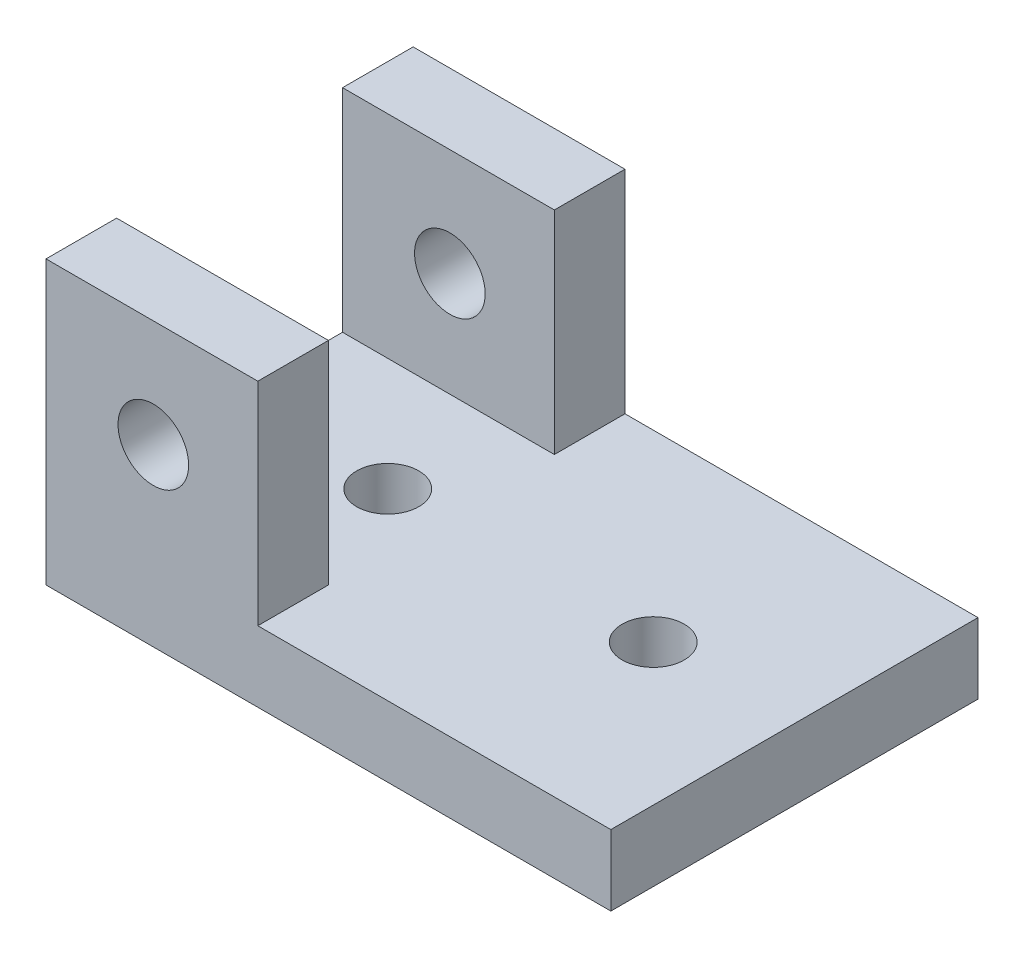
ISO-10303-21;
HEADER;
FILE_DESCRIPTION(('STEP AP214'),'2;1');
FILE_NAME('part.step','',(''),(''),'','','');
FILE_SCHEMA(('AUTOMOTIVE_DESIGN { 1 0 10303 214 1 1 1 1 }'));
ENDSEC;
DATA;
#1=APPLICATION_CONTEXT('core data for automotive mechanical design processes');
#2=APPLICATION_PROTOCOL_DEFINITION('international standard','automotive_design',2000,#1);
#3=PRODUCT_CONTEXT('',#1,'mechanical');
#4=PRODUCT('Part','Part','',(#3));
#5=PRODUCT_RELATED_PRODUCT_CATEGORY('part','',(#4));
#6=PRODUCT_DEFINITION_FORMATION('','',#4);
#7=PRODUCT_DEFINITION_CONTEXT('part definition',#1,'design');
#8=PRODUCT_DEFINITION('design','',#6,#7);
#9=PRODUCT_DEFINITION_SHAPE('','',#8);
#10=(LENGTH_UNIT() NAMED_UNIT(*) SI_UNIT(.MILLI.,.METRE.));
#11=(NAMED_UNIT(*) PLANE_ANGLE_UNIT() SI_UNIT($,.RADIAN.));
#12=(NAMED_UNIT(*) SI_UNIT($,.STERADIAN.) SOLID_ANGLE_UNIT());
#13=UNCERTAINTY_MEASURE_WITH_UNIT(LENGTH_MEASURE(1.E-05),#10,'distance_accuracy_value','');
#14=(GEOMETRIC_REPRESENTATION_CONTEXT(3) GLOBAL_UNCERTAINTY_ASSIGNED_CONTEXT((#13)) GLOBAL_UNIT_ASSIGNED_CONTEXT((#10,
#11,#12)) REPRESENTATION_CONTEXT('',''));
#15=CARTESIAN_POINT('',(0.,0.,0.));
#16=DIRECTION('',(0.,0.,1.));
#17=DIRECTION('',(1.,0.,0.));
#18=AXIS2_PLACEMENT_3D('',#15,#16,#17);
#19=CARTESIAN_POINT('',(0.,6.35,0.));
#20=DIRECTION('',(0.,-1.,0.));
#21=DIRECTION('',(0.,0.,-1.));
#22=AXIS2_PLACEMENT_3D('',#19,#20,#21);
#23=PLANE('',#22);
#24=CARTESIAN_POINT('',(14.224,6.35,-16.51));
#25=DIRECTION('',(0.,1.,0.));
#26=DIRECTION('',(0.,0.,1.));
#27=AXIS2_PLACEMENT_3D('',#24,#25,#26);
#28=CIRCLE('',#27,2.794);
#29=CARTESIAN_POINT('',(14.224,6.35,-13.716));
#30=VERTEX_POINT('',#29);
#31=EDGE_CURVE('E180',#30,#30,#28,.T.);
#32=ORIENTED_EDGE('',*,*,#31,.F.);
#33=EDGE_LOOP('',(#32));
#34=FACE_BOUND('',#33,.T.);
#35=CARTESIAN_POINT('',(38.1,6.35,-16.51));
#36=DIRECTION('',(0.,1.,0.));
#37=DIRECTION('',(0.,0.,1.));
#38=AXIS2_PLACEMENT_3D('',#35,#36,#37);
#39=CIRCLE('',#38,2.794);
#40=CARTESIAN_POINT('',(38.1,6.35,-13.716));
#41=VERTEX_POINT('',#40);
#42=EDGE_CURVE('E176',#41,#41,#39,.T.);
#43=ORIENTED_EDGE('',*,*,#42,.F.);
#44=EDGE_LOOP('',(#43));
#45=FACE_BOUND('',#44,.T.);
#46=DIRECTION('',(0.,0.,1.));
#47=VECTOR('',#46,1.);
#48=CARTESIAN_POINT('',(19.05,6.35,-33.02));
#49=LINE('',#48,#47);
#50=CARTESIAN_POINT('',(19.05,6.35,-33.02));
#51=VERTEX_POINT('',#50);
#52=CARTESIAN_POINT('',(19.05,6.35,-26.67));
#53=VERTEX_POINT('',#52);
#54=EDGE_CURVE('E55',#51,#53,#49,.T.);
#55=ORIENTED_EDGE('',*,*,#54,.T.);
#56=DIRECTION('',(-1.,0.,0.));
#57=VECTOR('',#56,1.);
#58=CARTESIAN_POINT('',(19.05,6.35,-26.67));
#59=LINE('',#58,#57);
#60=CARTESIAN_POINT('',(0.,6.35,-26.67));
#61=VERTEX_POINT('',#60);
#62=EDGE_CURVE('E148',#53,#61,#59,.T.);
#63=ORIENTED_EDGE('',*,*,#62,.T.);
#64=DIRECTION('',(0.,0.,1.));
#65=VECTOR('',#64,1.);
#66=CARTESIAN_POINT('',(0.,6.35,0.));
#67=LINE('',#66,#65);
#68=CARTESIAN_POINT('',(0.,6.35,-6.35));
#69=VERTEX_POINT('',#68);
#70=EDGE_CURVE('E124',#61,#69,#67,.T.);
#71=ORIENTED_EDGE('',*,*,#70,.T.);
#72=DIRECTION('',(-1.,0.,0.));
#73=VECTOR('',#72,1.);
#74=CARTESIAN_POINT('',(19.05,6.35,-6.35));
#75=LINE('',#74,#73);
#76=CARTESIAN_POINT('',(19.05,6.35,-6.35));
#77=VERTEX_POINT('',#76);
#78=EDGE_CURVE('E158',#77,#69,#75,.T.);
#79=ORIENTED_EDGE('',*,*,#78,.F.);
#80=DIRECTION('',(0.,0.,-1.));
#81=VECTOR('',#80,1.);
#82=CARTESIAN_POINT('',(19.05,6.35,0.));
#83=LINE('',#82,#81);
#84=CARTESIAN_POINT('',(19.05,6.35,0.));
#85=VERTEX_POINT('',#84);
#86=EDGE_CURVE('E128',#85,#77,#83,.T.);
#87=ORIENTED_EDGE('',*,*,#86,.F.);
#88=DIRECTION('',(1.,0.,0.));
#89=VECTOR('',#88,1.);
#90=CARTESIAN_POINT('',(50.8,6.35,0.));
#91=LINE('',#90,#89);
#92=CARTESIAN_POINT('',(50.8,6.35,0.));
#93=VERTEX_POINT('',#92);
#94=EDGE_CURVE('E189',#85,#93,#91,.T.);
#95=ORIENTED_EDGE('',*,*,#94,.T.);
#96=DIRECTION('',(0.,0.,-1.));
#97=VECTOR('',#96,1.);
#98=CARTESIAN_POINT('',(50.8,6.35,-33.02));
#99=LINE('',#98,#97);
#100=CARTESIAN_POINT('',(50.8,6.35,-33.02));
#101=VERTEX_POINT('',#100);
#102=EDGE_CURVE('E191',#93,#101,#99,.T.);
#103=ORIENTED_EDGE('',*,*,#102,.T.);
#104=DIRECTION('',(-1.,0.,0.));
#105=VECTOR('',#104,1.);
#106=CARTESIAN_POINT('',(0.,6.35,-33.02));
#107=LINE('',#106,#105);
#108=EDGE_CURVE('E60',#101,#51,#107,.T.);
#109=ORIENTED_EDGE('',*,*,#108,.T.);
#110=EDGE_LOOP('',(#55,#63,#71,#79,#87,#95,#103,#109));
#111=FACE_BOUND('',#110,.T.);
#112=ADVANCED_FACE('F39',(#34,#45,#111),#23,.F.);
#113=CARTESIAN_POINT('',(50.8,6.35,0.));
#114=DIRECTION('',(0.,0.,-1.));
#115=DIRECTION('',(-1.,0.,0.));
#116=AXIS2_PLACEMENT_3D('',#113,#114,#115);
#117=PLANE('',#116);
#118=CARTESIAN_POINT('',(9.652,15.748,0.));
#119=DIRECTION('',(0.,0.,1.));
#120=DIRECTION('',(1.,0.,0.));
#121=AXIS2_PLACEMENT_3D('',#118,#119,#120);
#122=CIRCLE('',#121,3.175);
#123=CARTESIAN_POINT('',(12.827,15.748,0.));
#124=VERTEX_POINT('',#123);
#125=EDGE_CURVE('E382',#124,#124,#122,.T.);
#126=ORIENTED_EDGE('',*,*,#125,.F.);
#127=EDGE_LOOP('',(#126));
#128=FACE_BOUND('',#127,.T.);
#129=DIRECTION('',(1.,0.,0.));
#130=VECTOR('',#129,1.);
#131=CARTESIAN_POINT('',(50.8,0.,0.));
#132=LINE('',#131,#130);
#133=CARTESIAN_POINT('',(0.,0.,0.));
#134=VERTEX_POINT('',#133);
#135=CARTESIAN_POINT('',(50.8,0.,0.));
#136=VERTEX_POINT('',#135);
#137=EDGE_CURVE('E186',#134,#136,#132,.T.);
#138=ORIENTED_EDGE('',*,*,#137,.T.);
#139=DIRECTION('',(0.,-1.,0.));
#140=VECTOR('',#139,1.);
#141=CARTESIAN_POINT('',(50.8,6.35,0.));
#142=LINE('',#141,#140);
#143=EDGE_CURVE('E11',#93,#136,#142,.T.);
#144=ORIENTED_EDGE('',*,*,#143,.F.);
#145=ORIENTED_EDGE('',*,*,#94,.F.);
#146=DIRECTION('',(0.,-1.,0.));
#147=VECTOR('',#146,1.);
#148=CARTESIAN_POINT('',(19.05,25.4,0.));
#149=LINE('',#148,#147);
#150=CARTESIAN_POINT('',(19.05,25.4,0.));
#151=VERTEX_POINT('',#150);
#152=EDGE_CURVE('E173',#151,#85,#149,.T.);
#153=ORIENTED_EDGE('',*,*,#152,.F.);
#154=DIRECTION('',(1.,0.,0.));
#155=VECTOR('',#154,1.);
#156=CARTESIAN_POINT('',(0.,25.4,0.));
#157=LINE('',#156,#155);
#158=CARTESIAN_POINT('',(0.,25.4,0.));
#159=VERTEX_POINT('',#158);
#160=EDGE_CURVE('E157',#159,#151,#157,.T.);
#161=ORIENTED_EDGE('',*,*,#160,.F.);
#162=DIRECTION('',(0.,-1.,0.));
#163=VECTOR('',#162,1.);
#164=CARTESIAN_POINT('',(0.,6.35,0.));
#165=LINE('',#164,#163);
#166=EDGE_CURVE('E196',#159,#134,#165,.T.);
#167=ORIENTED_EDGE('',*,*,#166,.T.);
#168=EDGE_LOOP('',(#138,#144,#145,#153,#161,#167));
#169=FACE_BOUND('',#168,.T.);
#170=ADVANCED_FACE('F41',(#128,#169),#117,.F.);
#171=CARTESIAN_POINT('',(50.8,6.35,-33.02));
#172=DIRECTION('',(-1.,0.,0.));
#173=DIRECTION('',(0.,0.,1.));
#174=AXIS2_PLACEMENT_3D('',#171,#172,#173);
#175=PLANE('',#174);
#176=DIRECTION('',(0.,0.,-1.));
#177=VECTOR('',#176,1.);
#178=CARTESIAN_POINT('',(50.8,0.,-33.02));
#179=LINE('',#178,#177);
#180=CARTESIAN_POINT('',(50.8,0.,-33.02));
#181=VERTEX_POINT('',#180);
#182=EDGE_CURVE('E199',#136,#181,#179,.T.);
#183=ORIENTED_EDGE('',*,*,#182,.T.);
#184=DIRECTION('',(0.,-1.,0.));
#185=VECTOR('',#184,1.);
#186=CARTESIAN_POINT('',(50.8,6.35,-33.02));
#187=LINE('',#186,#185);
#188=EDGE_CURVE('E48',#101,#181,#187,.T.);
#189=ORIENTED_EDGE('',*,*,#188,.F.);
#190=ORIENTED_EDGE('',*,*,#102,.F.);
#191=ORIENTED_EDGE('',*,*,#143,.T.);
#192=EDGE_LOOP('',(#183,#189,#190,#191));
#193=FACE_BOUND('',#192,.T.);
#194=ADVANCED_FACE('F253',(#193),#175,.F.);
#195=CARTESIAN_POINT('',(0.,6.35,-33.02));
#196=DIRECTION('',(0.,0.,1.));
#197=DIRECTION('',(1.,0.,0.));
#198=AXIS2_PLACEMENT_3D('',#195,#196,#197);
#199=PLANE('',#198);
#200=CARTESIAN_POINT('',(9.652,15.748,-33.02));
#201=DIRECTION('',(0.,0.,1.));
#202=DIRECTION('',(1.,0.,0.));
#203=AXIS2_PLACEMENT_3D('',#200,#201,#202);
#204=CIRCLE('',#203,3.175);
#205=CARTESIAN_POINT('',(12.827,15.748,-33.02));
#206=VERTEX_POINT('',#205);
#207=EDGE_CURVE('E150',#206,#206,#204,.T.);
#208=ORIENTED_EDGE('',*,*,#207,.T.);
#209=EDGE_LOOP('',(#208));
#210=FACE_BOUND('',#209,.T.);
#211=DIRECTION('',(-1.,0.,0.));
#212=VECTOR('',#211,1.);
#213=CARTESIAN_POINT('',(0.,0.,-33.02));
#214=LINE('',#213,#212);
#215=CARTESIAN_POINT('',(0.,0.,-33.02));
#216=VERTEX_POINT('',#215);
#217=EDGE_CURVE('E201',#181,#216,#214,.T.);
#218=ORIENTED_EDGE('',*,*,#217,.T.);
#219=DIRECTION('',(0.,-1.,0.));
#220=VECTOR('',#219,1.);
#221=CARTESIAN_POINT('',(0.,6.35,-33.02));
#222=LINE('',#221,#220);
#223=CARTESIAN_POINT('',(0.,25.4,-33.02));
#224=VERTEX_POINT('',#223);
#225=EDGE_CURVE('E206',#224,#216,#222,.T.);
#226=ORIENTED_EDGE('',*,*,#225,.F.);
#227=DIRECTION('',(1.,0.,0.));
#228=VECTOR('',#227,1.);
#229=CARTESIAN_POINT('',(0.,25.4,-33.02));
#230=LINE('',#229,#228);
#231=CARTESIAN_POINT('',(19.05,25.4,-33.02));
#232=VERTEX_POINT('',#231);
#233=EDGE_CURVE('E138',#224,#232,#230,.T.);
#234=ORIENTED_EDGE('',*,*,#233,.T.);
#235=DIRECTION('',(0.,-1.,0.));
#236=VECTOR('',#235,1.);
#237=CARTESIAN_POINT('',(19.05,25.4,-33.02));
#238=LINE('',#237,#236);
#239=EDGE_CURVE('E147',#232,#51,#238,.T.);
#240=ORIENTED_EDGE('',*,*,#239,.T.);
#241=ORIENTED_EDGE('',*,*,#108,.F.);
#242=ORIENTED_EDGE('',*,*,#188,.T.);
#243=EDGE_LOOP('',(#218,#226,#234,#240,#241,#242));
#244=FACE_BOUND('',#243,.T.);
#245=ADVANCED_FACE('F212',(#210,#244),#199,.F.);
#246=CARTESIAN_POINT('',(0.,6.35,0.));
#247=DIRECTION('',(1.,0.,0.));
#248=DIRECTION('',(0.,0.,-1.));
#249=AXIS2_PLACEMENT_3D('',#246,#247,#248);
#250=PLANE('',#249);
#251=DIRECTION('',(0.,0.,1.));
#252=VECTOR('',#251,1.);
#253=CARTESIAN_POINT('',(0.,0.,0.));
#254=LINE('',#253,#252);
#255=EDGE_CURVE('E192',#216,#134,#254,.T.);
#256=ORIENTED_EDGE('',*,*,#255,.T.);
#257=ORIENTED_EDGE('',*,*,#166,.F.);
#258=DIRECTION('',(0.,0.,1.));
#259=VECTOR('',#258,1.);
#260=CARTESIAN_POINT('',(0.,25.4,-6.35));
#261=LINE('',#260,#259);
#262=CARTESIAN_POINT('',(0.,25.4,-6.35));
#263=VERTEX_POINT('',#262);
#264=EDGE_CURVE('E154',#263,#159,#261,.T.);
#265=ORIENTED_EDGE('',*,*,#264,.F.);
#266=DIRECTION('',(0.,-1.,0.));
#267=VECTOR('',#266,1.);
#268=CARTESIAN_POINT('',(0.,25.4,-6.35));
#269=LINE('',#268,#267);
#270=EDGE_CURVE('E164',#263,#69,#269,.T.);
#271=ORIENTED_EDGE('',*,*,#270,.T.);
#272=ORIENTED_EDGE('',*,*,#70,.F.);
#273=DIRECTION('',(0.,-1.,0.));
#274=VECTOR('',#273,1.);
#275=CARTESIAN_POINT('',(0.,25.4,-26.67));
#276=LINE('',#275,#274);
#277=CARTESIAN_POINT('',(0.,25.4,-26.67));
#278=VERTEX_POINT('',#277);
#279=EDGE_CURVE('E117',#278,#61,#276,.T.);
#280=ORIENTED_EDGE('',*,*,#279,.F.);
#281=DIRECTION('',(0.,0.,-1.));
#282=VECTOR('',#281,1.);
#283=CARTESIAN_POINT('',(0.,25.4,-26.67));
#284=LINE('',#283,#282);
#285=EDGE_CURVE('E121',#278,#224,#284,.T.);
#286=ORIENTED_EDGE('',*,*,#285,.T.);
#287=ORIENTED_EDGE('',*,*,#225,.T.);
#288=EDGE_LOOP('',(#256,#257,#265,#271,#272,#280,#286,#287));
#289=FACE_BOUND('',#288,.T.);
#290=ADVANCED_FACE('F119',(#289),#250,.F.);
#291=CARTESIAN_POINT('',(0.,0.,0.));
#292=DIRECTION('',(0.,-1.,0.));
#293=DIRECTION('',(0.,0.,-1.));
#294=AXIS2_PLACEMENT_3D('',#291,#292,#293);
#295=PLANE('',#294);
#296=CARTESIAN_POINT('',(38.1,0.,-16.51));
#297=DIRECTION('',(0.,1.,0.));
#298=DIRECTION('',(0.,0.,1.));
#299=AXIS2_PLACEMENT_3D('',#296,#297,#298);
#300=CIRCLE('',#299,2.794);
#301=CARTESIAN_POINT('',(38.1,0.,-13.716));
#302=VERTEX_POINT('',#301);
#303=EDGE_CURVE('E177',#302,#302,#300,.T.);
#304=ORIENTED_EDGE('',*,*,#303,.T.);
#305=EDGE_LOOP('',(#304));
#306=FACE_BOUND('',#305,.T.);
#307=CARTESIAN_POINT('',(14.224,0.,-16.51));
#308=DIRECTION('',(0.,1.,0.));
#309=DIRECTION('',(0.,0.,1.));
#310=AXIS2_PLACEMENT_3D('',#307,#308,#309);
#311=CIRCLE('',#310,2.794);
#312=CARTESIAN_POINT('',(14.224,0.,-13.716));
#313=VERTEX_POINT('',#312);
#314=EDGE_CURVE('E183',#313,#313,#311,.T.);
#315=ORIENTED_EDGE('',*,*,#314,.T.);
#316=EDGE_LOOP('',(#315));
#317=FACE_BOUND('',#316,.T.);
#318=ORIENTED_EDGE('',*,*,#137,.F.);
#319=ORIENTED_EDGE('',*,*,#255,.F.);
#320=ORIENTED_EDGE('',*,*,#217,.F.);
#321=ORIENTED_EDGE('',*,*,#182,.F.);
#322=EDGE_LOOP('',(#318,#319,#320,#321));
#323=FACE_BOUND('',#322,.T.);
#324=ADVANCED_FACE('F218',(#306,#317,#323),#295,.T.);
#325=CARTESIAN_POINT('',(14.224,0.,-16.51));
#326=DIRECTION('',(0.,1.,0.));
#327=DIRECTION('',(0.,0.,1.));
#328=AXIS2_PLACEMENT_3D('',#325,#326,#327);
#329=CYLINDRICAL_SURFACE('',#328,2.794);
#330=ORIENTED_EDGE('',*,*,#314,.F.);
#331=EDGE_LOOP('',(#330));
#332=FACE_BOUND('',#331,.T.);
#333=ORIENTED_EDGE('',*,*,#31,.T.);
#334=EDGE_LOOP('',(#333));
#335=FACE_BOUND('',#334,.T.);
#336=ADVANCED_FACE('F244',(#332,#335),#329,.F.);
#337=CARTESIAN_POINT('',(38.1,0.,-16.51));
#338=DIRECTION('',(0.,1.,0.));
#339=DIRECTION('',(0.,0.,1.));
#340=AXIS2_PLACEMENT_3D('',#337,#338,#339);
#341=CYLINDRICAL_SURFACE('',#340,2.794);
#342=ORIENTED_EDGE('',*,*,#303,.F.);
#343=EDGE_LOOP('',(#342));
#344=FACE_BOUND('',#343,.T.);
#345=ORIENTED_EDGE('',*,*,#42,.T.);
#346=EDGE_LOOP('',(#345));
#347=FACE_BOUND('',#346,.T.);
#348=ADVANCED_FACE('F236',(#344,#347),#341,.F.);
#349=CARTESIAN_POINT('',(19.05,25.4,0.));
#350=DIRECTION('',(-1.,0.,0.));
#351=DIRECTION('',(0.,0.,1.));
#352=AXIS2_PLACEMENT_3D('',#349,#350,#351);
#353=PLANE('',#352);
#354=ORIENTED_EDGE('',*,*,#86,.T.);
#355=DIRECTION('',(0.,-1.,0.));
#356=VECTOR('',#355,1.);
#357=CARTESIAN_POINT('',(19.05,25.4,-6.35));
#358=LINE('',#357,#356);
#359=CARTESIAN_POINT('',(19.05,25.4,-6.35));
#360=VERTEX_POINT('',#359);
#361=EDGE_CURVE('E170',#360,#77,#358,.T.);
#362=ORIENTED_EDGE('',*,*,#361,.F.);
#363=DIRECTION('',(0.,0.,-1.));
#364=VECTOR('',#363,1.);
#365=CARTESIAN_POINT('',(19.05,25.4,0.));
#366=LINE('',#365,#364);
#367=EDGE_CURVE('E160',#151,#360,#366,.T.);
#368=ORIENTED_EDGE('',*,*,#367,.F.);
#369=ORIENTED_EDGE('',*,*,#152,.T.);
#370=EDGE_LOOP('',(#354,#362,#368,#369));
#371=FACE_BOUND('',#370,.T.);
#372=ADVANCED_FACE('F234',(#371),#353,.F.);
#373=CARTESIAN_POINT('',(19.05,25.4,-6.35));
#374=DIRECTION('',(0.,0.,1.));
#375=DIRECTION('',(1.,0.,0.));
#376=AXIS2_PLACEMENT_3D('',#373,#374,#375);
#377=PLANE('',#376);
#378=CARTESIAN_POINT('',(9.652,15.748,-6.35));
#379=DIRECTION('',(0.,0.,1.));
#380=DIRECTION('',(1.,0.,0.));
#381=AXIS2_PLACEMENT_3D('',#378,#379,#380);
#382=CIRCLE('',#381,3.175);
#383=CARTESIAN_POINT('',(12.827,15.748,-6.35));
#384=VERTEX_POINT('',#383);
#385=EDGE_CURVE('E385',#384,#384,#382,.T.);
#386=ORIENTED_EDGE('',*,*,#385,.T.);
#387=EDGE_LOOP('',(#386));
#388=FACE_BOUND('',#387,.T.);
#389=ORIENTED_EDGE('',*,*,#78,.T.);
#390=ORIENTED_EDGE('',*,*,#270,.F.);
#391=DIRECTION('',(-1.,0.,0.));
#392=VECTOR('',#391,1.);
#393=CARTESIAN_POINT('',(19.05,25.4,-6.35));
#394=LINE('',#393,#392);
#395=EDGE_CURVE('E162',#360,#263,#394,.T.);
#396=ORIENTED_EDGE('',*,*,#395,.F.);
#397=ORIENTED_EDGE('',*,*,#361,.T.);
#398=EDGE_LOOP('',(#389,#390,#396,#397));
#399=FACE_BOUND('',#398,.T.);
#400=ADVANCED_FACE('F231',(#388,#399),#377,.F.);
#401=CARTESIAN_POINT('',(0.,25.4,0.));
#402=DIRECTION('',(0.,1.,0.));
#403=DIRECTION('',(0.,0.,1.));
#404=AXIS2_PLACEMENT_3D('',#401,#402,#403);
#405=PLANE('',#404);
#406=ORIENTED_EDGE('',*,*,#264,.T.);
#407=ORIENTED_EDGE('',*,*,#160,.T.);
#408=ORIENTED_EDGE('',*,*,#367,.T.);
#409=ORIENTED_EDGE('',*,*,#395,.T.);
#410=EDGE_LOOP('',(#406,#407,#408,#409));
#411=FACE_BOUND('',#410,.T.);
#412=ADVANCED_FACE('F227',(#411),#405,.T.);
#413=CARTESIAN_POINT('',(19.05,25.4,-26.67));
#414=DIRECTION('',(0.,0.,1.));
#415=DIRECTION('',(1.,0.,0.));
#416=AXIS2_PLACEMENT_3D('',#413,#414,#415);
#417=PLANE('',#416);
#418=CARTESIAN_POINT('',(9.652,15.748,-26.67));
#419=DIRECTION('',(0.,0.,1.));
#420=DIRECTION('',(1.,0.,0.));
#421=AXIS2_PLACEMENT_3D('',#418,#419,#420);
#422=CIRCLE('',#421,3.175);
#423=CARTESIAN_POINT('',(12.827,15.748,-26.67));
#424=VERTEX_POINT('',#423);
#425=EDGE_CURVE('E43',#424,#424,#422,.T.);
#426=ORIENTED_EDGE('',*,*,#425,.F.);
#427=EDGE_LOOP('',(#426));
#428=FACE_BOUND('',#427,.T.);
#429=ORIENTED_EDGE('',*,*,#62,.F.);
#430=DIRECTION('',(0.,-1.,0.));
#431=VECTOR('',#430,1.);
#432=CARTESIAN_POINT('',(19.05,25.4,-26.67));
#433=LINE('',#432,#431);
#434=CARTESIAN_POINT('',(19.05,25.4,-26.67));
#435=VERTEX_POINT('',#434);
#436=EDGE_CURVE('E129',#435,#53,#433,.T.);
#437=ORIENTED_EDGE('',*,*,#436,.F.);
#438=DIRECTION('',(-1.,0.,0.));
#439=VECTOR('',#438,1.);
#440=CARTESIAN_POINT('',(19.05,25.4,-26.67));
#441=LINE('',#440,#439);
#442=EDGE_CURVE('E135',#435,#278,#441,.T.);
#443=ORIENTED_EDGE('',*,*,#442,.T.);
#444=ORIENTED_EDGE('',*,*,#279,.T.);
#445=EDGE_LOOP('',(#429,#437,#443,#444));
#446=FACE_BOUND('',#445,.T.);
#447=ADVANCED_FACE('F140',(#428,#446),#417,.T.);
#448=CARTESIAN_POINT('',(19.05,25.4,-33.02));
#449=DIRECTION('',(1.,0.,0.));
#450=DIRECTION('',(0.,0.,-1.));
#451=AXIS2_PLACEMENT_3D('',#448,#449,#450);
#452=PLANE('',#451);
#453=ORIENTED_EDGE('',*,*,#54,.F.);
#454=ORIENTED_EDGE('',*,*,#239,.F.);
#455=DIRECTION('',(0.,0.,1.));
#456=VECTOR('',#455,1.);
#457=CARTESIAN_POINT('',(19.05,25.4,-33.02));
#458=LINE('',#457,#456);
#459=EDGE_CURVE('E141',#232,#435,#458,.T.);
#460=ORIENTED_EDGE('',*,*,#459,.T.);
#461=ORIENTED_EDGE('',*,*,#436,.T.);
#462=EDGE_LOOP('',(#453,#454,#460,#461));
#463=FACE_BOUND('',#462,.T.);
#464=ADVANCED_FACE('F341',(#463),#452,.T.);
#465=CARTESIAN_POINT('',(0.,25.4,-33.02));
#466=DIRECTION('',(0.,1.,0.));
#467=DIRECTION('',(0.,0.,-1.));
#468=AXIS2_PLACEMENT_3D('',#465,#466,#467);
#469=PLANE('',#468);
#470=ORIENTED_EDGE('',*,*,#285,.F.);
#471=ORIENTED_EDGE('',*,*,#442,.F.);
#472=ORIENTED_EDGE('',*,*,#459,.F.);
#473=ORIENTED_EDGE('',*,*,#233,.F.);
#474=EDGE_LOOP('',(#470,#471,#472,#473));
#475=FACE_BOUND('',#474,.T.);
#476=ADVANCED_FACE('F133',(#475),#469,.T.);
#477=CARTESIAN_POINT('',(9.652,15.748,-34.29));
#478=DIRECTION('',(0.,0.,1.));
#479=DIRECTION('',(1.,0.,0.));
#480=AXIS2_PLACEMENT_3D('',#477,#478,#479);
#481=CYLINDRICAL_SURFACE('',#480,3.175);
#482=ORIENTED_EDGE('',*,*,#425,.T.);
#483=EDGE_LOOP('',(#482));
#484=FACE_BOUND('',#483,.T.);
#485=ORIENTED_EDGE('',*,*,#207,.F.);
#486=EDGE_LOOP('',(#485));
#487=FACE_BOUND('',#486,.T.);
#488=ADVANCED_FACE('F357',(#484,#487),#481,.F.);
#489=ORIENTED_EDGE('',*,*,#125,.T.);
#490=EDGE_LOOP('',(#489));
#491=FACE_BOUND('',#490,.T.);
#492=ORIENTED_EDGE('',*,*,#385,.F.);
#493=EDGE_LOOP('',(#492));
#494=FACE_BOUND('',#493,.T.);
#495=ADVANCED_FACE('F364',(#491,#494),#481,.F.);
#496=CLOSED_SHELL('',(#112,#170,#194,#245,#290,#324,#336,#348,#372,#400,#412,#447,#464,#476,
#488,#495));
#497=MANIFOLD_SOLID_BREP('B2',#496);
#498=ADVANCED_BREP_SHAPE_REPRESENTATION('',(#18,#497),#14);
#499=SHAPE_DEFINITION_REPRESENTATION(#9,#498);
ENDSEC;
END-ISO-10303-21;
